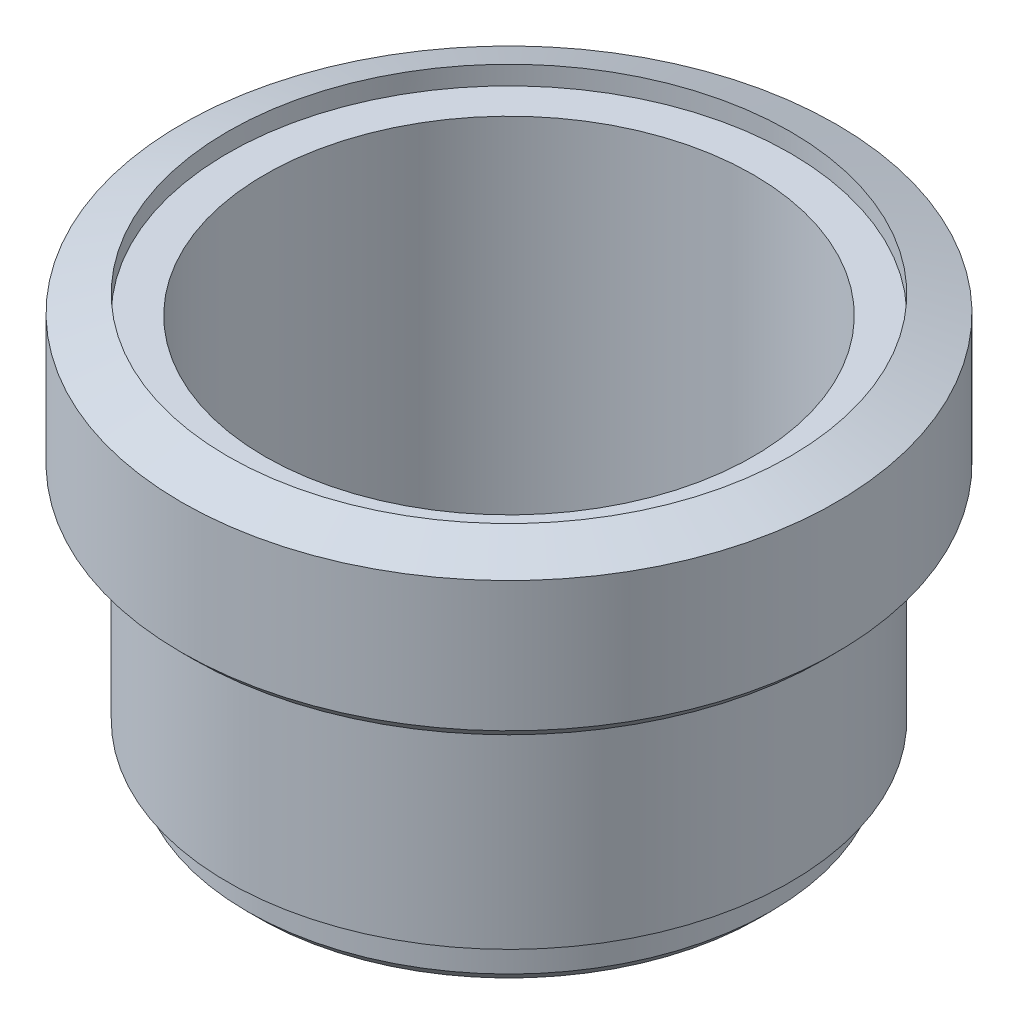
ISO-10303-21;
HEADER;
FILE_DESCRIPTION(('STEP AP214'),'2;1');
FILE_NAME('part.step','',(''),(''),'','','');
FILE_SCHEMA(('AUTOMOTIVE_DESIGN { 1 0 10303 214 1 1 1 1 }'));
ENDSEC;
DATA;
#1=APPLICATION_CONTEXT('core data for automotive mechanical design processes');
#2=APPLICATION_PROTOCOL_DEFINITION('international standard','automotive_design',2000,#1);
#3=PRODUCT_CONTEXT('',#1,'mechanical');
#4=PRODUCT('Part','Part','',(#3));
#5=PRODUCT_RELATED_PRODUCT_CATEGORY('part','',(#4));
#6=PRODUCT_DEFINITION_FORMATION('','',#4);
#7=PRODUCT_DEFINITION_CONTEXT('part definition',#1,'design');
#8=PRODUCT_DEFINITION('design','',#6,#7);
#9=PRODUCT_DEFINITION_SHAPE('','',#8);
#10=(LENGTH_UNIT() NAMED_UNIT(*) SI_UNIT(.MILLI.,.METRE.));
#11=(NAMED_UNIT(*) PLANE_ANGLE_UNIT() SI_UNIT($,.RADIAN.));
#12=(NAMED_UNIT(*) SI_UNIT($,.STERADIAN.) SOLID_ANGLE_UNIT());
#13=UNCERTAINTY_MEASURE_WITH_UNIT(LENGTH_MEASURE(1.E-05),#10,'distance_accuracy_value','');
#14=(GEOMETRIC_REPRESENTATION_CONTEXT(3) GLOBAL_UNCERTAINTY_ASSIGNED_CONTEXT((#13)) GLOBAL_UNIT_ASSIGNED_CONTEXT((#10,
#11,#12)) REPRESENTATION_CONTEXT('',''));
#15=CARTESIAN_POINT('',(0.,0.,0.));
#16=DIRECTION('',(0.,0.,1.));
#17=DIRECTION('',(1.,0.,0.));
#18=AXIS2_PLACEMENT_3D('',#15,#16,#17);
#19=CARTESIAN_POINT('',(0.,0.,0.));
#20=DIRECTION('',(0.,-1.,0.));
#21=DIRECTION('',(0.,0.,-1.));
#22=AXIS2_PLACEMENT_3D('',#19,#20,#21);
#23=PLANE('',#22);
#24=CARTESIAN_POINT('',(0.,0.,0.));
#25=DIRECTION('',(0.,-1.,0.));
#26=DIRECTION('',(0.,0.,-1.));
#27=AXIS2_PLACEMENT_3D('',#24,#25,#26);
#28=CIRCLE('',#27,9.144);
#29=CARTESIAN_POINT('',(0.,0.,-9.144));
#30=VERTEX_POINT('',#29);
#31=EDGE_CURVE('E46',#30,#30,#28,.T.);
#32=ORIENTED_EDGE('',*,*,#31,.F.);
#33=EDGE_LOOP('',(#32));
#34=FACE_BOUND('',#33,.T.);
#35=CARTESIAN_POINT('',(0.,0.,0.));
#36=DIRECTION('',(0.,1.,0.));
#37=DIRECTION('',(0.,0.,1.));
#38=AXIS2_PLACEMENT_3D('',#35,#36,#37);
#39=CIRCLE('',#38,10.2616);
#40=CARTESIAN_POINT('',(0.,0.,10.2616));
#41=VERTEX_POINT('',#40);
#42=EDGE_CURVE('E18',#41,#41,#39,.T.);
#43=ORIENTED_EDGE('',*,*,#42,.F.);
#44=EDGE_LOOP('',(#43));
#45=FACE_BOUND('',#44,.T.);
#46=ADVANCED_FACE('F15',(#34,#45),#23,.T.);
#47=CARTESIAN_POINT('',(0.,0.381000000000027,0.));
#48=DIRECTION('',(0.,1.,0.));
#49=DIRECTION('',(0.,0.,1.));
#50=AXIS2_PLACEMENT_3D('',#47,#48,#49);
#51=CONICAL_SURFACE('',#50,10.6426,0.7853981633973);
#52=ORIENTED_EDGE('',*,*,#42,.T.);
#53=EDGE_LOOP('',(#52));
#54=FACE_BOUND('',#53,.T.);
#55=CARTESIAN_POINT('',(0.,0.381,0.));
#56=DIRECTION('',(0.,-1.,0.));
#57=DIRECTION('',(0.,0.,-1.));
#58=AXIS2_PLACEMENT_3D('',#55,#56,#57);
#59=CIRCLE('',#58,10.6426);
#60=CARTESIAN_POINT('',(0.,0.381,-10.6426));
#61=VERTEX_POINT('',#60);
#62=EDGE_CURVE('E30',#61,#61,#59,.F.);
#63=ORIENTED_EDGE('',*,*,#62,.F.);
#64=EDGE_LOOP('',(#63));
#65=FACE_BOUND('',#64,.T.);
#66=ADVANCED_FACE('F54',(#54,#65),#51,.T.);
#67=CARTESIAN_POINT('',(0.,5.83184,0.));
#68=DIRECTION('',(0.,-1.,0.));
#69=DIRECTION('',(0.,0.,-1.));
#70=AXIS2_PLACEMENT_3D('',#67,#68,#69);
#71=CYLINDRICAL_SURFACE('',#70,9.144);
#72=CARTESIAN_POINT('',(0.,-6.8326,0.));
#73=DIRECTION('',(0.,-1.,0.));
#74=DIRECTION('',(0.,0.,-1.));
#75=AXIS2_PLACEMENT_3D('',#72,#73,#74);
#76=CIRCLE('',#75,9.144);
#77=CARTESIAN_POINT('',(0.,-6.8326,-9.144));
#78=VERTEX_POINT('',#77);
#79=EDGE_CURVE('E44',#78,#78,#76,.T.);
#80=ORIENTED_EDGE('',*,*,#79,.F.);
#81=EDGE_LOOP('',(#80));
#82=FACE_BOUND('',#81,.T.);
#83=ORIENTED_EDGE('',*,*,#31,.T.);
#84=EDGE_LOOP('',(#83));
#85=FACE_BOUND('',#84,.T.);
#86=ADVANCED_FACE('F63',(#82,#85),#71,.T.);
#87=CARTESIAN_POINT('',(0.,5.83184,0.));
#88=DIRECTION('',(0.,-1.,0.));
#89=DIRECTION('',(0.,0.,-1.));
#90=AXIS2_PLACEMENT_3D('',#87,#88,#89);
#91=CYLINDRICAL_SURFACE('',#90,10.6426);
#92=ORIENTED_EDGE('',*,*,#62,.T.);
#93=EDGE_LOOP('',(#92));
#94=FACE_BOUND('',#93,.T.);
#95=CARTESIAN_POINT('',(0.,4.61075420692746,0.));
#96=DIRECTION('',(0.,-1.,0.));
#97=DIRECTION('',(0.,0.,1.));
#98=AXIS2_PLACEMENT_3D('',#95,#96,#97);
#99=CIRCLE('',#98,10.6425999999995);
#100=CARTESIAN_POINT('',(0.,4.61075420692746,10.6425999999995));
#101=VERTEX_POINT('',#100);
#102=EDGE_CURVE('E43',#101,#101,#99,.F.);
#103=ORIENTED_EDGE('',*,*,#102,.F.);
#104=EDGE_LOOP('',(#103));
#105=FACE_BOUND('',#104,.T.);
#106=ADVANCED_FACE('F99',(#94,#105),#91,.T.);
#107=CARTESIAN_POINT('',(0.,-6.8326,0.));
#108=DIRECTION('',(0.,-1.,0.));
#109=DIRECTION('',(0.,0.,-1.));
#110=AXIS2_PLACEMENT_3D('',#107,#108,#109);
#111=PLANE('',#110);
#112=CARTESIAN_POINT('',(0.,-6.8326,0.));
#113=DIRECTION('',(0.,-1.,0.));
#114=DIRECTION('',(0.,0.,-1.));
#115=AXIS2_PLACEMENT_3D('',#112,#113,#114);
#116=CIRCLE('',#115,8.509);
#117=CARTESIAN_POINT('',(0.,-6.8326,-8.509));
#118=VERTEX_POINT('',#117);
#119=EDGE_CURVE('E39',#118,#118,#116,.T.);
#120=ORIENTED_EDGE('',*,*,#119,.F.);
#121=EDGE_LOOP('',(#120));
#122=FACE_BOUND('',#121,.T.);
#123=ORIENTED_EDGE('',*,*,#79,.T.);
#124=EDGE_LOOP('',(#123));
#125=FACE_BOUND('',#124,.T.);
#126=ADVANCED_FACE('F95',(#122,#125),#111,.T.);
#127=CARTESIAN_POINT('',(0.,4.61075420692746,0.));
#128=DIRECTION('',(0.,-1.,0.));
#129=DIRECTION('',(1.,0.,0.));
#130=AXIS2_PLACEMENT_3D('',#127,#128,#129);
#131=CONICAL_SURFACE('',#130,10.6425999999995,1.2217304763958);
#132=ORIENTED_EDGE('',*,*,#102,.T.);
#133=EDGE_LOOP('',(#132));
#134=FACE_BOUND('',#133,.T.);
#135=CARTESIAN_POINT('',(0.,5.1562,0.));
#136=DIRECTION('',(0.,-1.,0.));
#137=DIRECTION('',(0.,0.,-1.));
#138=AXIS2_PLACEMENT_3D('',#135,#136,#137);
#139=CIRCLE('',#138,9.144);
#140=CARTESIAN_POINT('',(0.,5.1562,-9.144));
#141=VERTEX_POINT('',#140);
#142=EDGE_CURVE('E42',#141,#141,#139,.T.);
#143=ORIENTED_EDGE('',*,*,#142,.T.);
#144=EDGE_LOOP('',(#143));
#145=FACE_BOUND('',#144,.T.);
#146=ADVANCED_FACE('F91',(#134,#145),#131,.T.);
#147=CARTESIAN_POINT('',(0.,5.83184,0.));
#148=DIRECTION('',(0.,-1.,0.));
#149=DIRECTION('',(0.,0.,-1.));
#150=AXIS2_PLACEMENT_3D('',#147,#148,#149);
#151=CYLINDRICAL_SURFACE('',#150,8.509);
#152=CARTESIAN_POINT('',(0.,-7.97559999999997,0.));
#153=DIRECTION('',(0.,1.,0.));
#154=DIRECTION('',(0.,0.,-1.));
#155=AXIS2_PLACEMENT_3D('',#152,#153,#154);
#156=CIRCLE('',#155,8.50899999999997);
#157=CARTESIAN_POINT('',(0.,-7.97559999999997,-8.50899999999997));
#158=VERTEX_POINT('',#157);
#159=EDGE_CURVE('E38',#158,#158,#156,.F.);
#160=ORIENTED_EDGE('',*,*,#159,.F.);
#161=EDGE_LOOP('',(#160));
#162=FACE_BOUND('',#161,.T.);
#163=ORIENTED_EDGE('',*,*,#119,.T.);
#164=EDGE_LOOP('',(#163));
#165=FACE_BOUND('',#164,.T.);
#166=ADVANCED_FACE('F87',(#162,#165),#151,.T.);
#167=CARTESIAN_POINT('',(0.,5.83184,0.));
#168=DIRECTION('',(0.,-1.,0.));
#169=DIRECTION('',(0.,0.,-1.));
#170=AXIS2_PLACEMENT_3D('',#167,#168,#169);
#171=CYLINDRICAL_SURFACE('',#170,9.144);
#172=ORIENTED_EDGE('',*,*,#142,.F.);
#173=EDGE_LOOP('',(#172));
#174=FACE_BOUND('',#173,.T.);
#175=CARTESIAN_POINT('',(0.,4.5466,0.));
#176=DIRECTION('',(0.,-1.,0.));
#177=DIRECTION('',(0.,0.,-1.));
#178=AXIS2_PLACEMENT_3D('',#175,#176,#177);
#179=CIRCLE('',#178,9.144);
#180=CARTESIAN_POINT('',(0.,4.5466,-9.144));
#181=VERTEX_POINT('',#180);
#182=EDGE_CURVE('E35',#181,#181,#179,.T.);
#183=ORIENTED_EDGE('',*,*,#182,.T.);
#184=EDGE_LOOP('',(#183));
#185=FACE_BOUND('',#184,.T.);
#186=ADVANCED_FACE('F83',(#174,#185),#171,.F.);
#187=CARTESIAN_POINT('',(0.,-7.97559999999997,0.));
#188=DIRECTION('',(0.,1.,0.));
#189=DIRECTION('',(-1.,0.,0.));
#190=AXIS2_PLACEMENT_3D('',#187,#188,#189);
#191=CONICAL_SURFACE('',#190,8.50899999999997,0.785398163397298);
#192=CARTESIAN_POINT('',(0.,-8.35660000000003,0.));
#193=DIRECTION('',(0.,1.,0.));
#194=DIRECTION('',(-1.,0.,0.));
#195=AXIS2_PLACEMENT_3D('',#192,#193,#194);
#196=CIRCLE('',#195,8.12800000000003);
#197=CARTESIAN_POINT('',(-8.12800000000003,-8.35660000000003,0.));
#198=VERTEX_POINT('',#197);
#199=EDGE_CURVE('E27',#198,#198,#196,.F.);
#200=ORIENTED_EDGE('',*,*,#199,.F.);
#201=EDGE_LOOP('',(#200));
#202=FACE_BOUND('',#201,.T.);
#203=ORIENTED_EDGE('',*,*,#159,.T.);
#204=EDGE_LOOP('',(#203));
#205=FACE_BOUND('',#204,.T.);
#206=ADVANCED_FACE('F79',(#202,#205),#191,.T.);
#207=CARTESIAN_POINT('',(0.,4.5466,0.));
#208=DIRECTION('',(0.,-1.,0.));
#209=DIRECTION('',(0.,0.,-1.));
#210=AXIS2_PLACEMENT_3D('',#207,#208,#209);
#211=PLANE('',#210);
#212=CARTESIAN_POINT('',(0.,4.5466,0.));
#213=DIRECTION('',(0.,-1.,0.));
#214=DIRECTION('',(0.,0.,-1.));
#215=AXIS2_PLACEMENT_3D('',#212,#213,#214);
#216=CIRCLE('',#215,7.9375);
#217=CARTESIAN_POINT('',(0.,4.5466,-7.9375));
#218=VERTEX_POINT('',#217);
#219=EDGE_CURVE('E22',#218,#218,#216,.T.);
#220=ORIENTED_EDGE('',*,*,#219,.T.);
#221=EDGE_LOOP('',(#220));
#222=FACE_BOUND('',#221,.T.);
#223=ORIENTED_EDGE('',*,*,#182,.F.);
#224=EDGE_LOOP('',(#223));
#225=FACE_BOUND('',#224,.T.);
#226=ADVANCED_FACE('F72',(#222,#225),#211,.F.);
#227=CARTESIAN_POINT('',(0.,-8.3566,0.));
#228=DIRECTION('',(0.,-1.,0.));
#229=DIRECTION('',(0.,0.,-1.));
#230=AXIS2_PLACEMENT_3D('',#227,#228,#229);
#231=PLANE('',#230);
#232=CARTESIAN_POINT('',(0.,-8.3566,0.));
#233=DIRECTION('',(0.,-1.,0.));
#234=DIRECTION('',(0.,0.,-1.));
#235=AXIS2_PLACEMENT_3D('',#232,#233,#234);
#236=CIRCLE('',#235,7.9375);
#237=CARTESIAN_POINT('',(0.,-8.3566,-7.9375));
#238=VERTEX_POINT('',#237);
#239=EDGE_CURVE('E10',#238,#238,#236,.F.);
#240=ORIENTED_EDGE('',*,*,#239,.T.);
#241=EDGE_LOOP('',(#240));
#242=FACE_BOUND('',#241,.T.);
#243=ORIENTED_EDGE('',*,*,#199,.T.);
#244=EDGE_LOOP('',(#243));
#245=FACE_BOUND('',#244,.T.);
#246=ADVANCED_FACE('F66',(#242,#245),#231,.T.);
#247=CARTESIAN_POINT('',(0.,5.83184,0.));
#248=DIRECTION('',(0.,-1.,0.));
#249=DIRECTION('',(0.,0.,-1.));
#250=AXIS2_PLACEMENT_3D('',#247,#248,#249);
#251=CYLINDRICAL_SURFACE('',#250,7.9375);
#252=ORIENTED_EDGE('',*,*,#219,.F.);
#253=EDGE_LOOP('',(#252));
#254=FACE_BOUND('',#253,.T.);
#255=ORIENTED_EDGE('',*,*,#239,.F.);
#256=EDGE_LOOP('',(#255));
#257=FACE_BOUND('',#256,.T.);
#258=ADVANCED_FACE('F64',(#254,#257),#251,.F.);
#259=CLOSED_SHELL('',(#46,#66,#86,#106,#126,#146,#166,#186,#206,#226,#246,#258));
#260=MANIFOLD_SOLID_BREP('B1',#259);
#261=ADVANCED_BREP_SHAPE_REPRESENTATION('',(#18,#260),#14);
#262=SHAPE_DEFINITION_REPRESENTATION(#9,#261);
ENDSEC;
END-ISO-10303-21;
